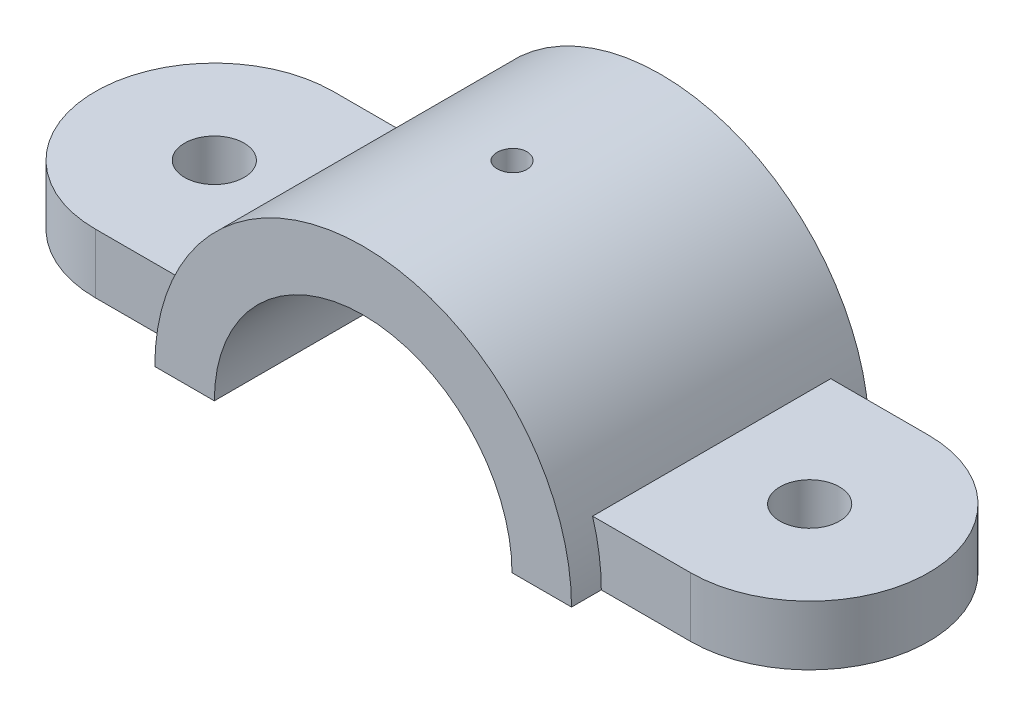
ISO-10303-21;
HEADER;
FILE_DESCRIPTION(('STEP AP214'),'2;1');
FILE_NAME('part.step','',(''),(''),'','','');
FILE_SCHEMA(('AUTOMOTIVE_DESIGN { 1 0 10303 214 1 1 1 1 }'));
ENDSEC;
DATA;
#1=APPLICATION_CONTEXT('core data for automotive mechanical design processes');
#2=APPLICATION_PROTOCOL_DEFINITION('international standard','automotive_design',2000,#1);
#3=PRODUCT_CONTEXT('',#1,'mechanical');
#4=PRODUCT('Part','Part','',(#3));
#5=PRODUCT_RELATED_PRODUCT_CATEGORY('part','',(#4));
#6=PRODUCT_DEFINITION_FORMATION('','',#4);
#7=PRODUCT_DEFINITION_CONTEXT('part definition',#1,'design');
#8=PRODUCT_DEFINITION('design','',#6,#7);
#9=PRODUCT_DEFINITION_SHAPE('','',#8);
#10=(LENGTH_UNIT() NAMED_UNIT(*) SI_UNIT(.MILLI.,.METRE.));
#11=(NAMED_UNIT(*) PLANE_ANGLE_UNIT() SI_UNIT($,.RADIAN.));
#12=(NAMED_UNIT(*) SI_UNIT($,.STERADIAN.) SOLID_ANGLE_UNIT());
#13=UNCERTAINTY_MEASURE_WITH_UNIT(LENGTH_MEASURE(1.E-05),#10,'distance_accuracy_value','');
#14=(GEOMETRIC_REPRESENTATION_CONTEXT(3) GLOBAL_UNCERTAINTY_ASSIGNED_CONTEXT((#13)) GLOBAL_UNIT_ASSIGNED_CONTEXT((#10,
#11,#12)) REPRESENTATION_CONTEXT('',''));
#15=CARTESIAN_POINT('',(0.,0.,0.));
#16=DIRECTION('',(0.,0.,1.));
#17=DIRECTION('',(1.,0.,0.));
#18=AXIS2_PLACEMENT_3D('',#15,#16,#17);
#19=CARTESIAN_POINT('',(-63.5,0.,0.));
#20=DIRECTION('',(0.,1.,0.));
#21=DIRECTION('',(0.,0.,1.));
#22=AXIS2_PLACEMENT_3D('',#19,#20,#21);
#23=PLANE('',#22);
#24=CARTESIAN_POINT('',(-63.5,0.,4.20088608509321E-13));
#25=DIRECTION('',(0.,1.,0.));
#26=DIRECTION('',(0.,0.,-1.));
#27=AXIS2_PLACEMENT_3D('',#24,#25,#26);
#28=CIRCLE('',#27,6.34999999999998);
#29=CARTESIAN_POINT('',(-63.5,0.,-6.34999999999956));
#30=VERTEX_POINT('',#29);
#31=EDGE_CURVE('E190',#30,#30,#28,.T.);
#32=ORIENTED_EDGE('',*,*,#31,.T.);
#33=EDGE_LOOP('',(#32));
#34=FACE_BOUND('',#33,.T.);
#35=DIRECTION('',(1.,0.,0.));
#36=VECTOR('',#35,1.);
#37=CARTESIAN_POINT('',(-44.45,0.,-31.75));
#38=LINE('',#37,#36);
#39=CARTESIAN_POINT('',(-44.45,0.,-31.75));
#40=VERTEX_POINT('',#39);
#41=CARTESIAN_POINT('',(-31.75,0.,-31.75));
#42=VERTEX_POINT('',#41);
#43=EDGE_CURVE('E165',#40,#42,#38,.T.);
#44=ORIENTED_EDGE('',*,*,#43,.T.);
#45=DIRECTION('',(0.,0.,1.));
#46=VECTOR('',#45,1.);
#47=CARTESIAN_POINT('',(-31.75,0.,-31.75));
#48=LINE('',#47,#46);
#49=CARTESIAN_POINT('',(-31.75,0.,31.75));
#50=VERTEX_POINT('',#49);
#51=EDGE_CURVE('E67',#42,#50,#48,.T.);
#52=ORIENTED_EDGE('',*,*,#51,.T.);
#53=DIRECTION('',(1.,0.,0.));
#54=VECTOR('',#53,1.);
#55=CARTESIAN_POINT('',(-44.45,0.,31.75));
#56=LINE('',#55,#54);
#57=CARTESIAN_POINT('',(-44.45,0.,31.75));
#58=VERTEX_POINT('',#57);
#59=EDGE_CURVE('E308',#58,#50,#56,.T.);
#60=ORIENTED_EDGE('',*,*,#59,.F.);
#61=DIRECTION('',(0.,0.,-1.));
#62=VECTOR('',#61,1.);
#63=CARTESIAN_POINT('',(-44.45,0.,31.75));
#64=LINE('',#63,#62);
#65=CARTESIAN_POINT('',(-44.45,0.,25.4));
#66=VERTEX_POINT('',#65);
#67=EDGE_CURVE('E176',#58,#66,#64,.T.);
#68=ORIENTED_EDGE('',*,*,#67,.T.);
#69=DIRECTION('',(1.,0.,0.));
#70=VECTOR('',#69,1.);
#71=CARTESIAN_POINT('',(-63.5,0.,25.4));
#72=LINE('',#71,#70);
#73=CARTESIAN_POINT('',(-63.5,0.,25.4));
#74=VERTEX_POINT('',#73);
#75=EDGE_CURVE('E216',#74,#66,#72,.T.);
#76=ORIENTED_EDGE('',*,*,#75,.F.);
#77=CARTESIAN_POINT('',(-63.5,0.,0.));
#78=DIRECTION('',(0.,1.,0.));
#79=DIRECTION('',(0.,0.,1.));
#80=AXIS2_PLACEMENT_3D('',#77,#78,#79);
#81=CIRCLE('',#80,25.4);
#82=CARTESIAN_POINT('',(-63.5,0.,-25.4));
#83=VERTEX_POINT('',#82);
#84=EDGE_CURVE('E196',#83,#74,#81,.T.);
#85=ORIENTED_EDGE('',*,*,#84,.F.);
#86=DIRECTION('',(-1.,0.,0.));
#87=VECTOR('',#86,1.);
#88=CARTESIAN_POINT('',(-63.5,0.,-25.4));
#89=LINE('',#88,#87);
#90=CARTESIAN_POINT('',(-44.45,0.,-25.4));
#91=VERTEX_POINT('',#90);
#92=EDGE_CURVE('E220',#91,#83,#89,.T.);
#93=ORIENTED_EDGE('',*,*,#92,.F.);
#94=EDGE_CURVE('E174',#91,#40,#64,.T.);
#95=ORIENTED_EDGE('',*,*,#94,.T.);
#96=EDGE_LOOP('',(#44,#52,#60,#68,#76,#85,#93,#95));
#97=FACE_BOUND('',#96,.T.);
#98=ADVANCED_FACE('F46',(#34,#97),#23,.F.);
#99=CARTESIAN_POINT('',(-63.5,12.7,0.));
#100=DIRECTION('',(0.,1.,0.));
#101=DIRECTION('',(0.,0.,1.));
#102=AXIS2_PLACEMENT_3D('',#99,#100,#101);
#103=PLANE('',#102);
#104=CARTESIAN_POINT('',(63.5,12.7,0.));
#105=DIRECTION('',(0.,1.,0.));
#106=DIRECTION('',(0.,0.,1.));
#107=AXIS2_PLACEMENT_3D('',#104,#105,#106);
#108=CIRCLE('',#107,6.35);
#109=CARTESIAN_POINT('',(63.5,12.7,6.34999999999997));
#110=VERTEX_POINT('',#109);
#111=EDGE_CURVE('E193',#110,#110,#108,.T.);
#112=ORIENTED_EDGE('',*,*,#111,.F.);
#113=EDGE_LOOP('',(#112));
#114=FACE_BOUND('',#113,.T.);
#115=DIRECTION('',(-1.,0.,0.));
#116=VECTOR('',#115,1.);
#117=CARTESIAN_POINT('',(-63.5,12.7,-25.4));
#118=LINE('',#117,#116);
#119=CARTESIAN_POINT('',(63.5,12.7,-25.4));
#120=VERTEX_POINT('',#119);
#121=CARTESIAN_POINT('',(42.597094971371,12.7,-25.4));
#122=VERTEX_POINT('',#121);
#123=EDGE_CURVE('E210',#120,#122,#118,.T.);
#124=ORIENTED_EDGE('',*,*,#123,.T.);
#125=DIRECTION('',(0.,0.,-1.));
#126=VECTOR('',#125,1.);
#127=CARTESIAN_POINT('',(42.597094971371,12.7,31.75));
#128=LINE('',#127,#126);
#129=CARTESIAN_POINT('',(42.597094971371,12.7,25.4));
#130=VERTEX_POINT('',#129);
#131=EDGE_CURVE('E75',#122,#130,#128,.F.);
#132=ORIENTED_EDGE('',*,*,#131,.T.);
#133=DIRECTION('',(1.,0.,0.));
#134=VECTOR('',#133,1.);
#135=CARTESIAN_POINT('',(-63.5,12.7,25.4));
#136=LINE('',#135,#134);
#137=CARTESIAN_POINT('',(63.5,12.7,25.4));
#138=VERTEX_POINT('',#137);
#139=EDGE_CURVE('E202',#130,#138,#136,.T.);
#140=ORIENTED_EDGE('',*,*,#139,.T.);
#141=CARTESIAN_POINT('',(63.5,12.7,0.));
#142=DIRECTION('',(0.,1.,0.));
#143=DIRECTION('',(0.,0.,1.));
#144=AXIS2_PLACEMENT_3D('',#141,#142,#143);
#145=CIRCLE('',#144,25.4);
#146=EDGE_CURVE('E207',#138,#120,#145,.T.);
#147=ORIENTED_EDGE('',*,*,#146,.T.);
#148=EDGE_LOOP('',(#124,#132,#140,#147));
#149=FACE_BOUND('',#148,.T.);
#150=ADVANCED_FACE('F257',(#114,#149),#103,.T.);
#151=CARTESIAN_POINT('',(-63.5,12.7,4.20088608509321E-13));
#152=DIRECTION('',(0.,1.,0.));
#153=DIRECTION('',(0.,0.,-1.));
#154=AXIS2_PLACEMENT_3D('',#151,#152,#153);
#155=CIRCLE('',#154,6.34999999999998);
#156=CARTESIAN_POINT('',(-63.5,12.7,-6.34999999999956));
#157=VERTEX_POINT('',#156);
#158=EDGE_CURVE('E186',#157,#157,#155,.T.);
#159=ORIENTED_EDGE('',*,*,#158,.F.);
#160=EDGE_LOOP('',(#159));
#161=FACE_BOUND('',#160,.T.);
#162=CARTESIAN_POINT('',(-63.5,12.7,25.4));
#163=VERTEX_POINT('',#162);
#164=CARTESIAN_POINT('',(-42.597094971371,12.7,25.4));
#165=VERTEX_POINT('',#164);
#166=EDGE_CURVE('E204',#163,#165,#136,.T.);
#167=ORIENTED_EDGE('',*,*,#166,.T.);
#168=DIRECTION('',(0.,0.,-1.));
#169=VECTOR('',#168,1.);
#170=CARTESIAN_POINT('',(-42.597094971371,12.7,31.75));
#171=LINE('',#170,#169);
#172=CARTESIAN_POINT('',(-42.597094971371,12.7,-25.4));
#173=VERTEX_POINT('',#172);
#174=EDGE_CURVE('E183',#165,#173,#171,.T.);
#175=ORIENTED_EDGE('',*,*,#174,.T.);
#176=CARTESIAN_POINT('',(-63.5,12.7,-25.4));
#177=VERTEX_POINT('',#176);
#178=EDGE_CURVE('E209',#173,#177,#118,.T.);
#179=ORIENTED_EDGE('',*,*,#178,.T.);
#180=CARTESIAN_POINT('',(-63.5,12.7,0.));
#181=DIRECTION('',(0.,1.,0.));
#182=DIRECTION('',(0.,0.,1.));
#183=AXIS2_PLACEMENT_3D('',#180,#181,#182);
#184=CIRCLE('',#183,25.4);
#185=EDGE_CURVE('E199',#177,#163,#184,.T.);
#186=ORIENTED_EDGE('',*,*,#185,.T.);
#187=EDGE_LOOP('',(#167,#175,#179,#186));
#188=FACE_BOUND('',#187,.T.);
#189=ADVANCED_FACE('F263',(#161,#188),#103,.T.);
#190=CARTESIAN_POINT('',(-63.5,12.7,25.4));
#191=DIRECTION('',(0.,0.,-1.));
#192=DIRECTION('',(-1.,0.,0.));
#193=AXIS2_PLACEMENT_3D('',#190,#191,#192);
#194=PLANE('',#193);
#195=CARTESIAN_POINT('',(0.,0.,25.4));
#196=DIRECTION('',(0.,0.,-1.));
#197=DIRECTION('',(-1.,0.,0.));
#198=AXIS2_PLACEMENT_3D('',#195,#196,#197);
#199=CIRCLE('',#198,44.45);
#200=CARTESIAN_POINT('',(44.45,0.,25.4));
#201=VERTEX_POINT('',#200);
#202=EDGE_CURVE('E180',#201,#130,#199,.F.);
#203=ORIENTED_EDGE('',*,*,#202,.F.);
#204=CARTESIAN_POINT('',(63.5,0.,25.4));
#205=VERTEX_POINT('',#204);
#206=EDGE_CURVE('E215',#201,#205,#72,.T.);
#207=ORIENTED_EDGE('',*,*,#206,.T.);
#208=DIRECTION('',(0.,-1.,0.));
#209=VECTOR('',#208,1.);
#210=CARTESIAN_POINT('',(63.5,12.7,25.4));
#211=LINE('',#210,#209);
#212=EDGE_CURVE('E227',#138,#205,#211,.T.);
#213=ORIENTED_EDGE('',*,*,#212,.F.);
#214=ORIENTED_EDGE('',*,*,#139,.F.);
#215=EDGE_LOOP('',(#203,#207,#213,#214));
#216=FACE_BOUND('',#215,.T.);
#217=ADVANCED_FACE('F287',(#216),#194,.F.);
#218=EDGE_CURVE('E184',#165,#66,#199,.F.);
#219=ORIENTED_EDGE('',*,*,#218,.F.);
#220=ORIENTED_EDGE('',*,*,#166,.F.);
#221=DIRECTION('',(0.,-1.,0.));
#222=VECTOR('',#221,1.);
#223=CARTESIAN_POINT('',(-63.5,12.7,25.4));
#224=LINE('',#223,#222);
#225=EDGE_CURVE('E230',#163,#74,#224,.T.);
#226=ORIENTED_EDGE('',*,*,#225,.T.);
#227=ORIENTED_EDGE('',*,*,#75,.T.);
#228=EDGE_LOOP('',(#219,#220,#226,#227));
#229=FACE_BOUND('',#228,.T.);
#230=ADVANCED_FACE('F281',(#229),#194,.F.);
#231=CARTESIAN_POINT('',(-63.5,12.7,-25.4));
#232=DIRECTION('',(0.,0.,1.));
#233=DIRECTION('',(1.,0.,0.));
#234=AXIS2_PLACEMENT_3D('',#231,#232,#233);
#235=PLANE('',#234);
#236=CARTESIAN_POINT('',(0.,0.,-25.4));
#237=DIRECTION('',(0.,0.,1.));
#238=DIRECTION('',(1.,0.,0.));
#239=AXIS2_PLACEMENT_3D('',#236,#237,#238);
#240=CIRCLE('',#239,44.45);
#241=EDGE_CURVE('E60',#91,#173,#240,.F.);
#242=ORIENTED_EDGE('',*,*,#241,.F.);
#243=ORIENTED_EDGE('',*,*,#92,.T.);
#244=DIRECTION('',(0.,-1.,0.));
#245=VECTOR('',#244,1.);
#246=CARTESIAN_POINT('',(-63.5,12.7,-25.4));
#247=LINE('',#246,#245);
#248=EDGE_CURVE('E212',#177,#83,#247,.T.);
#249=ORIENTED_EDGE('',*,*,#248,.F.);
#250=ORIENTED_EDGE('',*,*,#178,.F.);
#251=EDGE_LOOP('',(#242,#243,#249,#250));
#252=FACE_BOUND('',#251,.T.);
#253=ADVANCED_FACE('F276',(#252),#235,.F.);
#254=CARTESIAN_POINT('',(44.45,0.,-25.4));
#255=VERTEX_POINT('',#254);
#256=EDGE_CURVE('E233',#122,#255,#240,.F.);
#257=ORIENTED_EDGE('',*,*,#256,.F.);
#258=ORIENTED_EDGE('',*,*,#123,.F.);
#259=DIRECTION('',(0.,-1.,0.));
#260=VECTOR('',#259,1.);
#261=CARTESIAN_POINT('',(63.5,12.7,-25.4));
#262=LINE('',#261,#260);
#263=CARTESIAN_POINT('',(63.5,0.,-25.4));
#264=VERTEX_POINT('',#263);
#265=EDGE_CURVE('E224',#120,#264,#262,.T.);
#266=ORIENTED_EDGE('',*,*,#265,.T.);
#267=EDGE_CURVE('E203',#264,#255,#89,.T.);
#268=ORIENTED_EDGE('',*,*,#267,.T.);
#269=EDGE_LOOP('',(#257,#258,#266,#268));
#270=FACE_BOUND('',#269,.T.);
#271=ADVANCED_FACE('F269',(#270),#235,.F.);
#272=CARTESIAN_POINT('',(31.75,0.,31.75));
#273=VERTEX_POINT('',#272);
#274=CARTESIAN_POINT('',(44.45,0.,31.75));
#275=VERTEX_POINT('',#274);
#276=EDGE_CURVE('E159',#273,#275,#56,.T.);
#277=ORIENTED_EDGE('',*,*,#276,.F.);
#278=DIRECTION('',(0.,0.,1.));
#279=VECTOR('',#278,1.);
#280=CARTESIAN_POINT('',(31.75,0.,-31.75));
#281=LINE('',#280,#279);
#282=CARTESIAN_POINT('',(31.75,0.,-31.75));
#283=VERTEX_POINT('',#282);
#284=EDGE_CURVE('E143',#283,#273,#281,.T.);
#285=ORIENTED_EDGE('',*,*,#284,.F.);
#286=CARTESIAN_POINT('',(44.45,0.,-31.75));
#287=VERTEX_POINT('',#286);
#288=EDGE_CURVE('E156',#283,#287,#38,.T.);
#289=ORIENTED_EDGE('',*,*,#288,.T.);
#290=DIRECTION('',(0.,0.,-1.));
#291=VECTOR('',#290,1.);
#292=CARTESIAN_POINT('',(44.45,0.,31.75));
#293=LINE('',#292,#291);
#294=EDGE_CURVE('E175',#255,#287,#293,.T.);
#295=ORIENTED_EDGE('',*,*,#294,.F.);
#296=ORIENTED_EDGE('',*,*,#267,.F.);
#297=CARTESIAN_POINT('',(63.5,0.,0.));
#298=DIRECTION('',(0.,1.,0.));
#299=DIRECTION('',(0.,0.,1.));
#300=AXIS2_PLACEMENT_3D('',#297,#298,#299);
#301=CIRCLE('',#300,25.4);
#302=EDGE_CURVE('E218',#205,#264,#301,.T.);
#303=ORIENTED_EDGE('',*,*,#302,.F.);
#304=ORIENTED_EDGE('',*,*,#206,.F.);
#305=EDGE_CURVE('E171',#275,#201,#293,.T.);
#306=ORIENTED_EDGE('',*,*,#305,.F.);
#307=EDGE_LOOP('',(#277,#285,#289,#295,#296,#303,#304,#306));
#308=FACE_BOUND('',#307,.T.);
#309=CARTESIAN_POINT('',(63.5,0.,0.));
#310=DIRECTION('',(0.,1.,0.));
#311=DIRECTION('',(0.,0.,1.));
#312=AXIS2_PLACEMENT_3D('',#309,#310,#311);
#313=CIRCLE('',#312,6.35);
#314=CARTESIAN_POINT('',(63.5,0.,6.34999999999997));
#315=VERTEX_POINT('',#314);
#316=EDGE_CURVE('E189',#315,#315,#313,.T.);
#317=ORIENTED_EDGE('',*,*,#316,.T.);
#318=EDGE_LOOP('',(#317));
#319=FACE_BOUND('',#318,.T.);
#320=ADVANCED_FACE('F153',(#308,#319),#23,.F.);
#321=CARTESIAN_POINT('',(-63.5,12.7,0.));
#322=DIRECTION('',(0.,-1.,0.));
#323=DIRECTION('',(0.,0.,-1.));
#324=AXIS2_PLACEMENT_3D('',#321,#322,#323);
#325=CYLINDRICAL_SURFACE('',#324,25.4);
#326=ORIENTED_EDGE('',*,*,#84,.T.);
#327=ORIENTED_EDGE('',*,*,#225,.F.);
#328=ORIENTED_EDGE('',*,*,#185,.F.);
#329=ORIENTED_EDGE('',*,*,#248,.T.);
#330=EDGE_LOOP('',(#326,#327,#328,#329));
#331=FACE_BOUND('',#330,.T.);
#332=ADVANCED_FACE('F48',(#331),#325,.T.);
#333=CARTESIAN_POINT('',(63.5,12.7,0.));
#334=DIRECTION('',(0.,-1.,0.));
#335=DIRECTION('',(0.,0.,-1.));
#336=AXIS2_PLACEMENT_3D('',#333,#334,#335);
#337=CYLINDRICAL_SURFACE('',#336,25.4);
#338=ORIENTED_EDGE('',*,*,#302,.T.);
#339=ORIENTED_EDGE('',*,*,#265,.F.);
#340=ORIENTED_EDGE('',*,*,#146,.F.);
#341=ORIENTED_EDGE('',*,*,#212,.T.);
#342=EDGE_LOOP('',(#338,#339,#340,#341));
#343=FACE_BOUND('',#342,.T.);
#344=ADVANCED_FACE('F274',(#343),#337,.T.);
#345=CARTESIAN_POINT('',(63.5,12.7,0.));
#346=DIRECTION('',(0.,-1.,0.));
#347=DIRECTION('',(0.,0.,-1.));
#348=AXIS2_PLACEMENT_3D('',#345,#346,#347);
#349=CYLINDRICAL_SURFACE('',#348,6.35);
#350=ORIENTED_EDGE('',*,*,#111,.T.);
#351=EDGE_LOOP('',(#350));
#352=FACE_BOUND('',#351,.T.);
#353=ORIENTED_EDGE('',*,*,#316,.F.);
#354=EDGE_LOOP('',(#353));
#355=FACE_BOUND('',#354,.T.);
#356=ADVANCED_FACE('F285',(#352,#355),#349,.F.);
#357=CARTESIAN_POINT('',(-63.5,12.7,4.20088608509321E-13));
#358=DIRECTION('',(0.,-1.,0.));
#359=DIRECTION('',(0.,0.,-1.));
#360=AXIS2_PLACEMENT_3D('',#357,#358,#359);
#361=CYLINDRICAL_SURFACE('',#360,6.34999999999998);
#362=ORIENTED_EDGE('',*,*,#158,.T.);
#363=EDGE_LOOP('',(#362));
#364=FACE_BOUND('',#363,.T.);
#365=ORIENTED_EDGE('',*,*,#31,.F.);
#366=EDGE_LOOP('',(#365));
#367=FACE_BOUND('',#366,.T.);
#368=ADVANCED_FACE('F324',(#364,#367),#361,.F.);
#369=CARTESIAN_POINT('',(0.,0.,31.75));
#370=DIRECTION('',(0.,0.,-1.));
#371=DIRECTION('',(-1.,0.,0.));
#372=AXIS2_PLACEMENT_3D('',#369,#370,#371);
#373=CYLINDRICAL_SURFACE('',#372,44.45);
#374=CARTESIAN_POINT('',(0.,44.45,-3.175));
#375=CARTESIAN_POINT('',(0.17809755969062,44.4499985010204,-3.1749921852915));
#376=CARTESIAN_POINT('',(0.35631846093859,44.4489181935322,-3.15996439283334));
#377=CARTESIAN_POINT('',(0.707835270978344,44.4447124952987,-3.10023344384521));
#378=CARTESIAN_POINT('',(0.881125267556108,44.4415847492453,-3.05549610954538));
#379=CARTESIAN_POINT('',(1.21763791674399,44.4336378558182,-2.9376410589189));
#380=CARTESIAN_POINT('',(1.38086597659549,44.4288196263855,-2.86453874264178));
#381=CARTESIAN_POINT('',(1.69269346722433,44.418033060304,-2.69205484914637));
#382=CARTESIAN_POINT('',(1.84129615082639,44.4120649802704,-2.59267913359277));
#383=CARTESIAN_POINT('',(2.11997998340939,44.3996363409005,-2.37026268279305));
#384=CARTESIAN_POINT('',(2.25002939260178,44.3931749659727,-2.24718222035807));
#385=CARTESIAN_POINT('',(2.48764317829891,44.380494884107,-1.9809330348178));
#386=CARTESIAN_POINT('',(2.5952065966931,44.3742761875187,-1.83776345616511));
#387=CARTESIAN_POINT('',(2.78489768412392,44.3627762652838,-1.53521415441453));
#388=CARTESIAN_POINT('',(2.86699822922461,44.3574960418693,-1.37581738390362));
#389=CARTESIAN_POINT('',(3.00325964148284,44.3484793632232,-1.04545759664348));
#390=CARTESIAN_POINT('',(3.05742088477707,44.3447428872087,-0.874494735639384));
#391=CARTESIAN_POINT('',(3.13617617440064,44.3392430145078,-0.526167808778249));
#392=CARTESIAN_POINT('',(3.16082095687461,44.337476232457,-0.348815268475376));
#393=CARTESIAN_POINT('',(3.18000042163169,44.3361048630515,0.00751738406976762));
#394=CARTESIAN_POINT('',(3.17453553300967,44.3365002448835,0.186497473081446));
#395=CARTESIAN_POINT('',(3.1336928080948,44.3394054749584,0.540658150616265));
#396=CARTESIAN_POINT('',(3.09836996539516,44.3419114358203,0.715845117472151));
#397=CARTESIAN_POINT('',(2.9988993736118,44.3487493276067,1.05779706955871));
#398=CARTESIAN_POINT('',(2.93475140879975,44.353081272197,1.22456199174809));
#399=CARTESIAN_POINT('',(2.7793894028839,44.3630874612053,1.54511214283126));
#400=CARTESIAN_POINT('',(2.68815052276378,44.3687629365025,1.69888529294486));
#401=CARTESIAN_POINT('',(2.4812145802267,44.3808154538232,1.98895478384996));
#402=CARTESIAN_POINT('',(2.36551715598193,44.3871925062249,2.12525086604629));
#403=CARTESIAN_POINT('',(2.11263912589021,44.3999468565423,2.37681715563404));
#404=CARTESIAN_POINT('',(1.97541094694941,44.4063241229682,2.49203954889323));
#405=CARTESIAN_POINT('',(1.68353326582272,44.4183465899756,2.69781856552779));
#406=CARTESIAN_POINT('',(1.52888375563627,44.4239917902211,2.7883751775756));
#407=CARTESIAN_POINT('',(1.20652351982174,44.4339147067992,2.94224843922552));
#408=CARTESIAN_POINT('',(1.03881186894526,44.4381923261505,3.00556315708914));
#409=CARTESIAN_POINT('',(0.695101534536752,44.4448968658532,3.10312281529963));
#410=CARTESIAN_POINT('',(0.519102977405436,44.4473238144234,3.13736819889142));
#411=CARTESIAN_POINT('',(0.164229470601715,44.4500499204039,3.17575756562761));
#412=CARTESIAN_POINT('',(-0.0146382961204218,44.4503537489791,3.17996763115629));
#413=CARTESIAN_POINT('',(-0.370537321569539,44.4488118249658,3.15833969363806));
#414=CARTESIAN_POINT('',(-0.547568592818348,44.4469660870436,3.13250189560341));
#415=CARTESIAN_POINT('',(-0.894582312960256,44.4413357347358,3.05156640913193));
#416=CARTESIAN_POINT('',(-1.06457189733486,44.4375531376683,2.99649916218023));
#417=CARTESIAN_POINT('',(-1.39289741703371,44.4284743676534,2.85869891892336));
#418=CARTESIAN_POINT('',(-1.5512332159126,44.423178176988,2.77596559875991));
#419=CARTESIAN_POINT('',(-1.85205847074147,44.4116551142492,2.58501432949461));
#420=CARTESIAN_POINT('',(-1.99451993838108,44.4054266423692,2.47675238551611));
#421=CARTESIAN_POINT('',(-2.25927051769905,44.3927448859707,2.23788087230796));
#422=CARTESIAN_POINT('',(-2.38155937133055,44.3862915985778,2.10727101724873));
#423=CARTESIAN_POINT('',(-2.60271836127946,44.3738738792979,1.82712545316469));
#424=CARTESIAN_POINT('',(-2.70154552685789,44.3679103572931,1.67755577532192));
#425=CARTESIAN_POINT('',(-2.87268159958821,44.3571593354335,1.36390636365055));
#426=CARTESIAN_POINT('',(-2.94499071056565,44.3523718265397,1.19982674136168));
#427=CARTESIAN_POINT('',(-3.06096414564601,44.3445193603726,0.861970119106408));
#428=CARTESIAN_POINT('',(-3.10465522282774,44.3414527946903,0.688202341357345));
#429=CARTESIAN_POINT('',(-3.16223963020726,44.3373836261545,0.335774660840801));
#430=CARTESIAN_POINT('',(-3.17613336446705,44.3363809953135,0.157114824444557));
#431=CARTESIAN_POINT('',(-3.17372453217148,44.3365534587745,-0.199598343740229));
#432=CARTESIAN_POINT('',(-3.15748950229105,44.3377236824066,-0.377652137869705));
#433=CARTESIAN_POINT('',(-3.09542433897,44.3420996628091,-0.72849816555522));
#434=CARTESIAN_POINT('',(-3.0495941548471,44.3453054230655,-0.901290390100188));
#435=CARTESIAN_POINT('',(-2.92965566407163,44.3533900104309,-1.23671606520818));
#436=CARTESIAN_POINT('',(-2.85554804081302,44.3582687971069,-1.39934976116655));
#437=CARTESIAN_POINT('',(-2.68116669252534,44.3691496822712,-1.70987682459985));
#438=CARTESIAN_POINT('',(-2.58089353963294,44.375151756197,-1.85777051428274));
#439=CARTESIAN_POINT('',(-2.35677531436748,44.3876187401926,-2.13496369125892));
#440=CARTESIAN_POINT('',(-2.23288076532297,44.3940846036465,-2.26422313162537));
#441=CARTESIAN_POINT('',(-1.96511570862737,44.4067421131503,-2.50015779397602));
#442=CARTESIAN_POINT('',(-1.82124034274248,44.412933692025,-2.60682750740843));
#443=CARTESIAN_POINT('',(-1.51738984886767,44.4243532343972,-2.79465826526877));
#444=CARTESIAN_POINT('',(-1.35739121739497,44.429579758747,-2.87578133807944));
#445=CARTESIAN_POINT('',(-1.02612043812863,44.4384621486734,-3.00991083117564));
#446=CARTESIAN_POINT('',(-0.85486165953085,44.4421198394355,-3.06294994136929));
#447=CARTESIAN_POINT('',(-0.568807958256338,44.4465015797572,-3.12572942626643));
#448=CARTESIAN_POINT('',(-0.455858555116116,44.4478076013163,-3.14418173924639));
#449=CARTESIAN_POINT('',(-0.228623044805805,44.4495572918002,-3.16881952317773));
#450=CARTESIAN_POINT('',(-0.114336940124905,44.4500009623306,-3.17500501696856));
#451=CARTESIAN_POINT('',(0.,44.45,-3.175));
#452=B_SPLINE_CURVE_WITH_KNOTS('',3,(#374,#375,#376,#377,#378,#379,#380,#381,#382,#383,#384,
#385,#386,#387,#388,#389,#390,#391,#392,#393,#394,#395,#396,#397,#398,#399,#400,#401,#402,#403,
#404,#405,#406,#407,#408,#409,#410,#411,#412,#413,#414,#415,#416,#417,#418,#419,#420,#421,#422,
#423,#424,#425,#426,#427,#428,#429,#430,#431,#432,#433,#434,#435,#436,#437,#438,#439,#440,#441,
#442,#443,#444,#445,#446,#447,#448,#449,#450,#451),.UNSPECIFIED.,.T.,.F.,(4,2,2,2,2,2,2,2,2,2,2,
2,2,2,2,2,2,2,2,2,2,2,2,2,2,2,2,2,2,2,2,2,2,2,2,2,2,2,4),(0.,0.533875259235039,1.06836575339372,
1.60256646458327,2.13664809461002,2.67163271481404,3.20664012565184,3.74221550288008,
4.27778366966297,4.81242991554011,5.34706854215867,5.88072458989978,6.41438463160984,
6.94853549244861,7.48269425580817,8.01805033204644,8.5534066541421,9.08880093241042,
9.62418704691904,10.1583948641756,10.6925990366306,11.2262479419402,11.7599030943476,
12.2944847333891,12.8290732102362,13.3646333747321,13.9001894226693,14.4352440979471,
14.9702915176574,15.5041410228642,16.0379914423009,16.571828960744,17.105654807249,
17.6406113237351,18.1756981406486,18.7115765781027,19.2468298707823,19.5895733497411,
19.932316190549),.UNSPECIFIED.);
#453=CARTESIAN_POINT('',(0.,44.45,-3.175));
#454=VERTEX_POINT('',#453);
#455=EDGE_CURVE('E13',#454,#454,#452,.T.);
#456=ORIENTED_EDGE('',*,*,#455,.T.);
#457=EDGE_LOOP('',(#456));
#458=FACE_BOUND('',#457,.T.);
#459=ORIENTED_EDGE('',*,*,#174,.F.);
#460=ORIENTED_EDGE('',*,*,#218,.T.);
#461=ORIENTED_EDGE('',*,*,#67,.F.);
#462=CARTESIAN_POINT('',(0.,0.,31.75));
#463=DIRECTION('',(0.,0.,1.));
#464=DIRECTION('',(-1.,0.,0.));
#465=AXIS2_PLACEMENT_3D('',#462,#463,#464);
#466=CIRCLE('',#465,44.45);
#467=EDGE_CURVE('E167',#275,#58,#466,.T.);
#468=ORIENTED_EDGE('',*,*,#467,.F.);
#469=ORIENTED_EDGE('',*,*,#305,.T.);
#470=ORIENTED_EDGE('',*,*,#202,.T.);
#471=ORIENTED_EDGE('',*,*,#131,.F.);
#472=ORIENTED_EDGE('',*,*,#256,.T.);
#473=ORIENTED_EDGE('',*,*,#294,.T.);
#474=CARTESIAN_POINT('',(0.,0.,-31.75));
#475=DIRECTION('',(0.,0.,1.));
#476=DIRECTION('',(-1.,0.,0.));
#477=AXIS2_PLACEMENT_3D('',#474,#475,#476);
#478=CIRCLE('',#477,44.45);
#479=EDGE_CURVE('E164',#287,#40,#478,.T.);
#480=ORIENTED_EDGE('',*,*,#479,.T.);
#481=ORIENTED_EDGE('',*,*,#94,.F.);
#482=ORIENTED_EDGE('',*,*,#241,.T.);
#483=EDGE_LOOP('',(#459,#460,#461,#468,#469,#470,#471,#472,#473,#480,#481,#482));
#484=FACE_BOUND('',#483,.T.);
#485=ADVANCED_FACE('F239',(#458,#484),#373,.T.);
#486=CARTESIAN_POINT('',(0.,0.,31.75));
#487=DIRECTION('',(0.,0.,-1.));
#488=DIRECTION('',(-1.,0.,0.));
#489=AXIS2_PLACEMENT_3D('',#486,#487,#488);
#490=PLANE('',#489);
#491=ORIENTED_EDGE('',*,*,#59,.T.);
#492=CARTESIAN_POINT('',(0.,0.,31.75));
#493=DIRECTION('',(0.,0.,1.));
#494=DIRECTION('',(-1.,0.,0.));
#495=AXIS2_PLACEMENT_3D('',#492,#493,#494);
#496=CIRCLE('',#495,31.75);
#497=EDGE_CURVE('E149',#273,#50,#496,.T.);
#498=ORIENTED_EDGE('',*,*,#497,.F.);
#499=ORIENTED_EDGE('',*,*,#276,.T.);
#500=ORIENTED_EDGE('',*,*,#467,.T.);
#501=EDGE_LOOP('',(#491,#498,#499,#500));
#502=FACE_BOUND('',#501,.T.);
#503=ADVANCED_FACE('F249',(#502),#490,.F.);
#504=CARTESIAN_POINT('',(0.,0.,-31.75));
#505=DIRECTION('',(0.,0.,-1.));
#506=DIRECTION('',(-1.,0.,0.));
#507=AXIS2_PLACEMENT_3D('',#504,#505,#506);
#508=PLANE('',#507);
#509=CARTESIAN_POINT('',(0.,0.,-31.75));
#510=DIRECTION('',(0.,0.,1.));
#511=DIRECTION('',(-1.,0.,0.));
#512=AXIS2_PLACEMENT_3D('',#509,#510,#511);
#513=CIRCLE('',#512,31.75);
#514=EDGE_CURVE('E139',#283,#42,#513,.T.);
#515=ORIENTED_EDGE('',*,*,#514,.T.);
#516=ORIENTED_EDGE('',*,*,#43,.F.);
#517=ORIENTED_EDGE('',*,*,#479,.F.);
#518=ORIENTED_EDGE('',*,*,#288,.F.);
#519=EDGE_LOOP('',(#515,#516,#517,#518));
#520=FACE_BOUND('',#519,.T.);
#521=ADVANCED_FACE('F162',(#520),#508,.T.);
#522=CARTESIAN_POINT('',(0.,0.,0.));
#523=DIRECTION('',(0.,-1.,0.));
#524=DIRECTION('',(0.,0.,-1.));
#525=AXIS2_PLACEMENT_3D('',#522,#523,#524);
#526=CYLINDRICAL_SURFACE('',#525,3.175);
#527=CARTESIAN_POINT('',(0.,31.75,-3.175));
#528=CARTESIAN_POINT('',(0.177864623288194,31.7499979527844,-3.17499229776629));
#529=CARTESIAN_POINT('',(0.355846840907679,31.7484895126795,-3.16000362125378));
#530=CARTESIAN_POINT('',(0.706876915227456,31.7426170961329,-3.10043712432789));
#531=CARTESIAN_POINT('',(0.879919116361027,31.7382499737803,-3.05582670512193));
#532=CARTESIAN_POINT('',(1.21593506956459,31.7271531623775,-2.93832838610188));
#533=CARTESIAN_POINT('',(1.37891483365234,31.7204249004225,-2.86545756435384));
#534=CARTESIAN_POINT('',(1.69029431104929,31.7053581472692,-2.69354011731702));
#535=CARTESIAN_POINT('',(1.83869691562356,31.6970199763607,-2.59449869719956));
#536=CARTESIAN_POINT('',(2.11727907339021,31.679633882837,-2.37266893492228));
#537=CARTESIAN_POINT('',(2.24739880985078,31.6705837749702,-2.24980563689854));
#538=CARTESIAN_POINT('',(2.48520750554337,31.6528118817738,-1.98397960371488));
#539=CARTESIAN_POINT('',(2.59289542723742,31.6440901116461,-1.84101593936542));
#540=CARTESIAN_POINT('',(2.78299535615848,31.6279400318009,-1.5386731619045));
#541=CARTESIAN_POINT('',(2.86535325281924,31.6205145055712,-1.37925986499882));
#542=CARTESIAN_POINT('',(3.00210977155826,31.6078246921021,-1.04878001475169));
#543=CARTESIAN_POINT('',(3.05650908442734,31.6025603514655,-0.877713749445959));
#544=CARTESIAN_POINT('',(3.13562695708601,31.594808669317,-0.52939378225042));
#545=CARTESIAN_POINT('',(3.16044469828704,31.5923120501396,-0.352162818494239));
#546=CARTESIAN_POINT('',(3.18000153030476,31.5903496671717,0.00396514128160296));
#547=CARTESIAN_POINT('',(3.17474141171479,31.5908838237177,0.182862093387538));
#548=CARTESIAN_POINT('',(3.13437358980225,31.5949141690412,0.536560108276285));
#549=CARTESIAN_POINT('',(3.09937418009545,31.5983996107532,0.711373670368603));
#550=CARTESIAN_POINT('',(3.00068978267811,31.6079230136255,1.05263303316347));
#551=CARTESIAN_POINT('',(2.93700440746199,31.6139610092671,1.21907872079447));
#552=CARTESIAN_POINT('',(2.78263633807378,31.6279215501032,1.53921963967397));
#553=CARTESIAN_POINT('',(2.69190559763593,31.635847444084,1.69289155162858));
#554=CARTESIAN_POINT('',(2.48605683684649,31.6526878925189,1.98286755734522));
#555=CARTESIAN_POINT('',(2.3709381027184,31.6616024759059,2.1191711425921));
#556=CARTESIAN_POINT('',(2.11897630690832,31.6794637336874,2.37117062591516));
#557=CARTESIAN_POINT('',(1.98203972035308,31.6884103763227,2.48677303597155));
#558=CARTESIAN_POINT('',(1.69065410451533,31.705290573243,2.69336403449048));
#559=CARTESIAN_POINT('',(1.53620505559873,31.7132241263921,2.78435259535681));
#560=CARTESIAN_POINT('',(1.21411398557326,31.7271868524303,2.93912931448505));
#561=CARTESIAN_POINT('',(1.04646966978794,31.7332156931689,3.00291272929734));
#562=CARTESIAN_POINT('',(0.702777415022534,31.7426863062647,3.10140006055981));
#563=CARTESIAN_POINT('',(0.526729727515706,31.7461281559868,3.13610484662022));
#564=CARTESIAN_POINT('',(0.172037689616795,31.7500270404689,3.17533117705788));
#565=CARTESIAN_POINT('',(-0.00659225918493622,31.7504968325006,3.17998172820168));
#566=CARTESIAN_POINT('',(-0.362089043777346,31.7484328757783,3.15930640982017));
#567=CARTESIAN_POINT('',(-0.538955903354991,31.7458991676019,3.13398094527398));
#568=CARTESIAN_POINT('',(-0.88553355670009,31.7381211038694,3.05417951703649));
#569=CARTESIAN_POINT('',(-1.05525839548616,31.7328823658977,2.99976395703231));
#570=CARTESIAN_POINT('',(-1.3831707203935,31.7202819638243,2.86338907243166));
#571=CARTESIAN_POINT('',(-1.54135794774885,31.7129202521268,2.78142913029991));
#572=CARTESIAN_POINT('',(-1.84228797204655,31.6968655917409,2.59197208724207));
#573=CARTESIAN_POINT('',(-1.98497716970281,31.6881682594093,2.48439022766053));
#574=CARTESIAN_POINT('',(-2.25031815401521,31.6704323686073,2.24686473492255));
#575=CARTESIAN_POINT('',(-2.37296943759613,31.6613938015768,2.11692054050174));
#576=CARTESIAN_POINT('',(-2.59520089889168,31.643955766469,1.83779612545767));
#577=CARTESIAN_POINT('',(-2.69469640980755,31.6355587169125,1.68854832297717));
#578=CARTESIAN_POINT('',(-2.86720997151165,31.6203911806332,1.37538663153427));
#579=CARTESIAN_POINT('',(-2.94022838437107,31.6136206716682,1.21147294316434));
#580=CARTESIAN_POINT('',(-3.0575732875732,31.6024878373811,0.873922752196103));
#581=CARTESIAN_POINT('',(-3.10195015502765,31.5981212857808,0.700303907710692));
#582=CARTESIAN_POINT('',(-3.16091572263604,31.5922775977313,0.348033346474549));
#583=CARTESIAN_POINT('',(-3.17550527711846,31.5908003784134,0.169381774216235));
#584=CARTESIAN_POINT('',(-3.17447021464623,31.5909043411651,-0.187041435532537));
#585=CARTESIAN_POINT('',(-3.15897859945813,31.5924720602625,-0.364813478152938));
#586=CARTESIAN_POINT('',(-3.09849981315959,31.5984605484931,-0.715216112009314));
#587=CARTESIAN_POINT('',(-3.05351260886985,31.6028813208356,-0.887846697461484));
#588=CARTESIAN_POINT('',(-2.93535635399457,31.6140740673562,-1.22306508322694));
#589=CARTESIAN_POINT('',(-2.8621912032824,31.6208457161565,-1.38565426967437));
#590=CARTESIAN_POINT('',(-2.68976968684256,31.6359778708996,-1.69626563105553));
#591=CARTESIAN_POINT('',(-2.59051346722094,31.6443383679452,-1.8442878875555));
#592=CARTESIAN_POINT('',(-2.36822791620592,31.6617504689079,-2.12224516644839));
#593=CARTESIAN_POINT('',(-2.2450994877266,31.6708048550743,-2.2521007674655));
#594=CARTESIAN_POINT('',(-1.97876064503972,31.6885591376389,-2.48936583882141));
#595=CARTESIAN_POINT('',(-1.83554542754371,31.6972589486045,-2.59676992505901));
#596=CARTESIAN_POINT('',(-1.53270405346209,31.7133465956959,-2.78629571598842));
#597=CARTESIAN_POINT('',(-1.37303747917597,31.7207310728513,-2.86835307375095));
#598=CARTESIAN_POINT('',(-1.04222003614425,31.7333194786842,-3.00438319246578));
#599=CARTESIAN_POINT('',(-0.871082363196308,31.7385258646315,-3.05838761877751));
#600=CARTESIAN_POINT('',(-0.58247997996311,31.744863287316,-3.12331295924424));
#601=CARTESIAN_POINT('',(-0.466860105281314,31.7467805719657,-3.14266911565045));
#602=CARTESIAN_POINT('',(-0.234177144094968,31.7493495996875,-3.16851514524609));
#603=CARTESIAN_POINT('',(-0.117114063544321,31.7500013479788,-3.17500507149691));
#604=CARTESIAN_POINT('',(0.,31.75,-3.175));
#605=B_SPLINE_CURVE_WITH_KNOTS('',3,(#527,#528,#529,#530,#531,#532,#533,#534,#535,#536,#537,
#538,#539,#540,#541,#542,#543,#544,#545,#546,#547,#548,#549,#550,#551,#552,#553,#554,#555,#556,
#557,#558,#559,#560,#561,#562,#563,#564,#565,#566,#567,#568,#569,#570,#571,#572,#573,#574,#575,
#576,#577,#578,#579,#580,#581,#582,#583,#584,#585,#586,#587,#588,#589,#590,#591,#592,#593,#594,
#595,#596,#597,#598,#599,#600,#601,#602,#603,#604),.UNSPECIFIED.,.T.,.F.,(4,2,2,2,2,2,2,2,2,2,2,
2,2,2,2,2,2,2,2,2,2,2,2,2,2,2,2,2,2,2,2,2,2,2,2,2,2,2,4),(0.,0.533166212902403,1.06692015100267,
1.60035203719974,2.13367790682533,2.66870995537785,3.2037667452574,3.73995872124304,
4.27613744854949,4.81051336743498,5.3448752403709,5.87729956875525,6.40973108963186,
6.94311417358939,7.47651287051322,8.01226281072955,8.54801335160774,9.0838572670212,
9.61968515719519,10.1532114882963,10.6867306114828,11.2191461955942,11.7515737170706,
12.2857876187712,12.8200149304748,13.356165934573,13.8923096065931,14.4275076763278,
14.9626903958568,15.4955122300831,16.0283346636767,16.5610833802689,17.093829113612,
17.628835628328,18.1639702962234,18.7004525350832,19.2363278847506,19.587389934627,
19.9384505366916),.UNSPECIFIED.);
#606=CARTESIAN_POINT('',(0.,31.75,-3.175));
#607=VERTEX_POINT('',#606);
#608=EDGE_CURVE('E50',#607,#607,#605,.T.);
#609=ORIENTED_EDGE('',*,*,#608,.T.);
#610=EDGE_LOOP('',(#609));
#611=FACE_BOUND('',#610,.T.);
#612=ORIENTED_EDGE('',*,*,#455,.F.);
#613=EDGE_LOOP('',(#612));
#614=FACE_BOUND('',#613,.T.);
#615=ADVANCED_FACE('F243',(#611,#614),#526,.F.);
#616=CARTESIAN_POINT('',(0.,0.,-31.75));
#617=DIRECTION('',(0.,0.,1.));
#618=DIRECTION('',(1.,0.,0.));
#619=AXIS2_PLACEMENT_3D('',#616,#617,#618);
#620=CYLINDRICAL_SURFACE('',#619,31.75);
#621=ORIENTED_EDGE('',*,*,#497,.T.);
#622=ORIENTED_EDGE('',*,*,#51,.F.);
#623=ORIENTED_EDGE('',*,*,#514,.F.);
#624=ORIENTED_EDGE('',*,*,#284,.T.);
#625=EDGE_LOOP('',(#621,#622,#623,#624));
#626=FACE_BOUND('',#625,.T.);
#627=ORIENTED_EDGE('',*,*,#608,.F.);
#628=EDGE_LOOP('',(#627));
#629=FACE_BOUND('',#628,.T.);
#630=ADVANCED_FACE('F141',(#626,#629),#620,.F.);
#631=CLOSED_SHELL('',(#98,#150,#189,#217,#230,#253,#271,#320,#332,#344,#356,#368,#485,#503,#521,
#615,#630));
#632=MANIFOLD_SOLID_BREP('B2',#631);
#633=ADVANCED_BREP_SHAPE_REPRESENTATION('',(#18,#632),#14);
#634=SHAPE_DEFINITION_REPRESENTATION(#9,#633);
ENDSEC;
END-ISO-10303-21;
